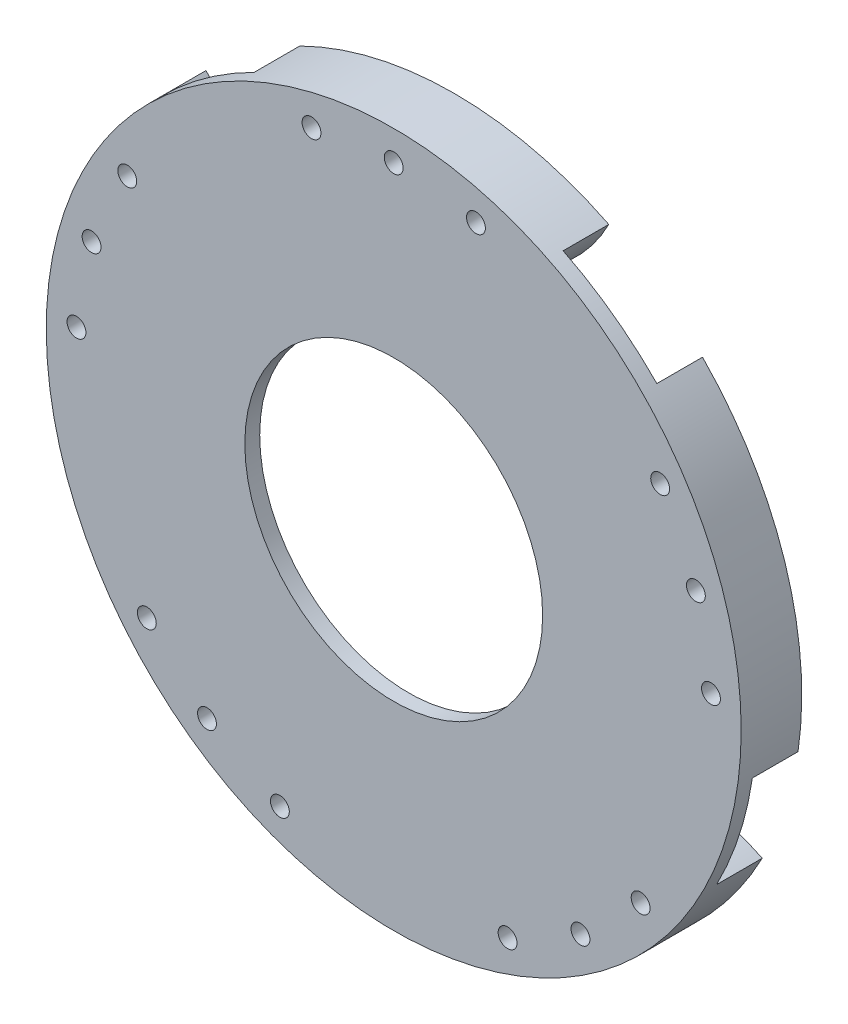
ISO-10303-21;
HEADER;
FILE_DESCRIPTION(('STEP AP214'),'2;1');
FILE_NAME('part.step','',(''),(''),'','','');
FILE_SCHEMA(('AUTOMOTIVE_DESIGN { 1 0 10303 214 1 1 1 1 }'));
ENDSEC;
DATA;
#1=APPLICATION_CONTEXT('core data for automotive mechanical design processes');
#2=APPLICATION_PROTOCOL_DEFINITION('international standard','automotive_design',2000,#1);
#3=PRODUCT_CONTEXT('',#1,'mechanical');
#4=PRODUCT('Part','Part','',(#3));
#5=PRODUCT_RELATED_PRODUCT_CATEGORY('part','',(#4));
#6=PRODUCT_DEFINITION_FORMATION('','',#4);
#7=PRODUCT_DEFINITION_CONTEXT('part definition',#1,'design');
#8=PRODUCT_DEFINITION('design','',#6,#7);
#9=PRODUCT_DEFINITION_SHAPE('','',#8);
#10=(LENGTH_UNIT() NAMED_UNIT(*) SI_UNIT(.MILLI.,.METRE.));
#11=(NAMED_UNIT(*) PLANE_ANGLE_UNIT() SI_UNIT($,.RADIAN.));
#12=(NAMED_UNIT(*) SI_UNIT($,.STERADIAN.) SOLID_ANGLE_UNIT());
#13=UNCERTAINTY_MEASURE_WITH_UNIT(LENGTH_MEASURE(1.E-05),#10,'distance_accuracy_value','');
#14=(GEOMETRIC_REPRESENTATION_CONTEXT(3) GLOBAL_UNCERTAINTY_ASSIGNED_CONTEXT((#13)) GLOBAL_UNIT_ASSIGNED_CONTEXT((#10,
#11,#12)) REPRESENTATION_CONTEXT('',''));
#15=CARTESIAN_POINT('',(0.,0.,0.));
#16=DIRECTION('',(0.,0.,1.));
#17=DIRECTION('',(1.,0.,0.));
#18=AXIS2_PLACEMENT_3D('',#15,#16,#17);
#19=CARTESIAN_POINT('',(0.,0.,1.5));
#20=DIRECTION('',(0.,0.,-1.));
#21=DIRECTION('',(-1.,0.,0.));
#22=AXIS2_PLACEMENT_3D('',#19,#20,#21);
#23=CYLINDRICAL_SURFACE('',#22,35.);
#24=CARTESIAN_POINT('',(0.,0.,1.5));
#25=DIRECTION('',(0.,0.,1.));
#26=DIRECTION('',(1.,0.,0.));
#27=AXIS2_PLACEMENT_3D('',#24,#25,#26);
#28=CIRCLE('',#27,35.);
#29=CARTESIAN_POINT('',(35.,0.,1.5));
#30=VERTEX_POINT('',#29);
#31=EDGE_CURVE('E11',#30,#30,#28,.T.);
#32=ORIENTED_EDGE('',*,*,#31,.F.);
#33=EDGE_LOOP('',(#32));
#34=FACE_BOUND('',#33,.T.);
#35=CARTESIAN_POINT('',(0.,0.,0.));
#36=DIRECTION('',(0.,0.,1.));
#37=DIRECTION('',(1.,0.,0.));
#38=AXIS2_PLACEMENT_3D('',#35,#36,#37);
#39=CIRCLE('',#38,35.);
#40=CARTESIAN_POINT('',(-15.5639088802974,31.3490787801779,0.));
#41=VERTEX_POINT('',#40);
#42=CARTESIAN_POINT('',(-25.0052333108233,24.4895550607048,0.));
#43=VERTEX_POINT('',#42);
#44=EDGE_CURVE('E43',#41,#43,#39,.T.);
#45=ORIENTED_EDGE('',*,*,#44,.T.);
#46=DIRECTION('',(0.,0.,1.));
#47=VECTOR('',#46,1.);
#48=CARTESIAN_POINT('',(-25.0052333108233,24.4895550607048,-4.6));
#49=LINE('',#48,#47);
#50=CARTESIAN_POINT('',(-25.0052333108233,24.4895550607048,-4.6));
#51=VERTEX_POINT('',#50);
#52=EDGE_CURVE('E169',#51,#43,#49,.T.);
#53=ORIENTED_EDGE('',*,*,#52,.F.);
#54=CARTESIAN_POINT('',(0.,0.,-4.6));
#55=DIRECTION('',(0.,0.,-1.));
#56=DIRECTION('',(-0.309016994374945,-0.951056516295155,0.));
#57=AXIS2_PLACEMENT_3D('',#54,#55,#56);
#58=CIRCLE('',#57,35.);
#59=CARTESIAN_POINT('',(-34.6242579966533,-5.11475885855693,-4.6));
#60=VERTEX_POINT('',#59);
#61=EDGE_CURVE('E159',#60,#51,#58,.T.);
#62=ORIENTED_EDGE('',*,*,#61,.F.);
#63=DIRECTION('',(0.,0.,1.));
#64=VECTOR('',#63,1.);
#65=CARTESIAN_POINT('',(-34.6242579966533,-5.11475885855693,-4.6));
#66=LINE('',#65,#64);
#67=CARTESIAN_POINT('',(-34.6242579966533,-5.11475885855693,0.));
#68=VERTEX_POINT('',#67);
#69=EDGE_CURVE('E164',#60,#68,#66,.T.);
#70=ORIENTED_EDGE('',*,*,#69,.T.);
#71=CARTESIAN_POINT('',(-31.0179929630072,-16.2137013833005,0.));
#72=VERTEX_POINT('',#71);
#73=EDGE_CURVE('E204',#68,#72,#39,.T.);
#74=ORIENTED_EDGE('',*,*,#73,.T.);
#75=DIRECTION('',(0.,0.,1.));
#76=VECTOR('',#75,1.);
#77=CARTESIAN_POINT('',(-31.0179929630072,-16.2137013833005,-4.6));
#78=LINE('',#77,#76);
#79=CARTESIAN_POINT('',(-31.0179929630072,-16.2137013833005,-4.6));
#80=VERTEX_POINT('',#79);
#81=EDGE_CURVE('E155',#80,#72,#78,.T.);
#82=ORIENTED_EDGE('',*,*,#81,.F.);
#83=CARTESIAN_POINT('',(0.,0.,-4.6));
#84=DIRECTION('',(0.,0.,-1.));
#85=DIRECTION('',(0.809016994374951,-0.587785252292469,0.));
#86=AXIS2_PLACEMENT_3D('',#83,#84,#85);
#87=CIRCLE('',#86,35.);
#88=CARTESIAN_POINT('',(-5.83505939687952,-34.5101735990257,-4.6));
#89=VERTEX_POINT('',#88);
#90=EDGE_CURVE('E145',#89,#80,#87,.T.);
#91=ORIENTED_EDGE('',*,*,#90,.F.);
#92=DIRECTION('',(0.,0.,1.));
#93=VECTOR('',#92,1.);
#94=CARTESIAN_POINT('',(-5.83505939687952,-34.5101735990257,-4.6));
#95=LINE('',#94,#93);
#96=CARTESIAN_POINT('',(-5.83505939687952,-34.5101735990257,0.));
#97=VERTEX_POINT('',#96);
#98=EDGE_CURVE('E150',#89,#97,#95,.T.);
#99=ORIENTED_EDGE('',*,*,#98,.T.);
#100=CARTESIAN_POINT('',(5.83505939688002,-34.5101735990256,0.));
#101=VERTEX_POINT('',#100);
#102=EDGE_CURVE('E207',#97,#101,#39,.T.);
#103=ORIENTED_EDGE('',*,*,#102,.T.);
#104=DIRECTION('',(0.,0.,1.));
#105=VECTOR('',#104,1.);
#106=CARTESIAN_POINT('',(5.83505939688003,-34.5101735990256,-4.6));
#107=LINE('',#106,#105);
#108=CARTESIAN_POINT('',(5.83505939688003,-34.5101735990256,-4.6));
#109=VERTEX_POINT('',#108);
#110=EDGE_CURVE('E141',#109,#101,#107,.T.);
#111=ORIENTED_EDGE('',*,*,#110,.F.);
#112=CARTESIAN_POINT('',(0.,0.,-4.6));
#113=DIRECTION('',(0.,0.,-1.));
#114=DIRECTION('',(0.809016994374942,0.58778525229248,0.));
#115=AXIS2_PLACEMENT_3D('',#112,#113,#114);
#116=CIRCLE('',#115,35.);
#117=CARTESIAN_POINT('',(31.0179929630074,-16.2137013833,-4.6));
#118=VERTEX_POINT('',#117);
#119=EDGE_CURVE('E130',#118,#109,#116,.T.);
#120=ORIENTED_EDGE('',*,*,#119,.F.);
#121=DIRECTION('',(0.,0.,1.));
#122=VECTOR('',#121,1.);
#123=CARTESIAN_POINT('',(31.0179929630074,-16.2137013833,-4.6));
#124=LINE('',#123,#122);
#125=CARTESIAN_POINT('',(31.0179929630074,-16.2137013833,0.));
#126=VERTEX_POINT('',#125);
#127=EDGE_CURVE('E138',#118,#126,#124,.T.);
#128=ORIENTED_EDGE('',*,*,#127,.T.);
#129=CARTESIAN_POINT('',(34.6242579966534,-5.11475885855645,0.));
#130=VERTEX_POINT('',#129);
#131=EDGE_CURVE('E128',#126,#130,#39,.T.);
#132=ORIENTED_EDGE('',*,*,#131,.T.);
#133=DIRECTION('',(0.,0.,1.));
#134=VECTOR('',#133,1.);
#135=CARTESIAN_POINT('',(34.6242579966534,-5.11475885855645,-4.6));
#136=LINE('',#135,#134);
#137=CARTESIAN_POINT('',(34.6242579966534,-5.11475885855645,-4.6));
#138=VERTEX_POINT('',#137);
#139=EDGE_CURVE('E116',#138,#130,#136,.T.);
#140=ORIENTED_EDGE('',*,*,#139,.F.);
#141=CARTESIAN_POINT('',(0.,0.,-4.6));
#142=DIRECTION('',(0.,0.,-1.));
#143=DIRECTION('',(-0.309016994374958,0.95105651629515,0.));
#144=AXIS2_PLACEMENT_3D('',#141,#142,#143);
#145=CIRCLE('',#144,35.);
#146=CARTESIAN_POINT('',(25.005233310823,24.4895550607051,-4.6));
#147=VERTEX_POINT('',#146);
#148=EDGE_CURVE('E121',#147,#138,#145,.T.);
#149=ORIENTED_EDGE('',*,*,#148,.F.);
#150=DIRECTION('',(0.,0.,1.));
#151=VECTOR('',#150,1.);
#152=CARTESIAN_POINT('',(25.005233310823,24.4895550607051,-4.6));
#153=LINE('',#152,#151);
#154=CARTESIAN_POINT('',(25.005233310823,24.4895550607051,0.));
#155=VERTEX_POINT('',#154);
#156=EDGE_CURVE('E118',#147,#155,#153,.T.);
#157=ORIENTED_EDGE('',*,*,#156,.T.);
#158=CARTESIAN_POINT('',(15.5639088802974,31.3490787801779,0.));
#159=VERTEX_POINT('',#158);
#160=EDGE_CURVE('E203',#155,#159,#39,.T.);
#161=ORIENTED_EDGE('',*,*,#160,.T.);
#162=DIRECTION('',(0.,0.,1.));
#163=VECTOR('',#162,1.);
#164=CARTESIAN_POINT('',(15.5639088802974,31.3490787801779,-4.6));
#165=LINE('',#164,#163);
#166=CARTESIAN_POINT('',(15.5639088802974,31.3490787801779,-4.6));
#167=VERTEX_POINT('',#166);
#168=EDGE_CURVE('E201',#167,#159,#165,.T.);
#169=ORIENTED_EDGE('',*,*,#168,.F.);
#170=CARTESIAN_POINT('',(0.,0.,-4.6));
#171=DIRECTION('',(0.,0.,-1.));
#172=DIRECTION('',(-1.,0.,0.));
#173=AXIS2_PLACEMENT_3D('',#170,#171,#172);
#174=CIRCLE('',#173,35.);
#175=CARTESIAN_POINT('',(-15.5639088802974,31.3490787801779,-4.6));
#176=VERTEX_POINT('',#175);
#177=EDGE_CURVE('E191',#176,#167,#174,.T.);
#178=ORIENTED_EDGE('',*,*,#177,.F.);
#179=DIRECTION('',(0.,0.,1.));
#180=VECTOR('',#179,1.);
#181=CARTESIAN_POINT('',(-15.5639088802974,31.3490787801779,-4.6));
#182=LINE('',#181,#180);
#183=EDGE_CURVE('E196',#176,#41,#182,.T.);
#184=ORIENTED_EDGE('',*,*,#183,.T.);
#185=EDGE_LOOP('',(#45,#53,#62,#70,#74,#82,#91,#99,#103,#111,#120,#128,#132,#140,#149,#157,#161,
#169,#178,#184));
#186=FACE_BOUND('',#185,.T.);
#187=ADVANCED_FACE('F35',(#34,#186),#23,.T.);
#188=CARTESIAN_POINT('',(0.,0.,1.5));
#189=DIRECTION('',(0.,0.,1.));
#190=DIRECTION('',(1.,0.,0.));
#191=AXIS2_PLACEMENT_3D('',#188,#189,#190);
#192=PLANE('',#191);
#193=CARTESIAN_POINT('',(0.,0.,1.5));
#194=DIRECTION('',(0.,0.,1.));
#195=DIRECTION('',(1.,0.,0.));
#196=AXIS2_PLACEMENT_3D('',#193,#194,#195);
#197=CIRCLE('',#196,15.);
#198=CARTESIAN_POINT('',(15.,0.,1.5));
#199=VERTEX_POINT('',#198);
#200=EDGE_CURVE('E370',#199,#199,#197,.T.);
#201=ORIENTED_EDGE('',*,*,#200,.F.);
#202=EDGE_LOOP('',(#201));
#203=FACE_BOUND('',#202,.T.);
#204=CARTESIAN_POINT('',(31.9561451121463,1.67475059977455,1.5));
#205=DIRECTION('',(0.,0.,1.));
#206=DIRECTION('',(0.0523359562429546,-0.998629534754573,0.));
#207=AXIS2_PLACEMENT_3D('',#204,#205,#206);
#208=CIRCLE('',#207,0.95);
#209=CARTESIAN_POINT('',(32.0058642705772,0.726052541757701,1.5));
#210=VERTEX_POINT('',#209);
#211=EDGE_CURVE('E365',#210,#210,#208,.T.);
#212=ORIENTED_EDGE('',*,*,#211,.F.);
#213=EDGE_LOOP('',(#212));
#214=FACE_BOUND('',#213,.T.);
#215=CARTESIAN_POINT('',(11.4677743854499,-29.8745736479104,1.5));
#216=DIRECTION('',(0.,0.,1.));
#217=DIRECTION('',(-0.933580426497199,-0.358367949545308,0.));
#218=AXIS2_PLACEMENT_3D('',#215,#216,#217);
#219=CIRCLE('',#218,0.95);
#220=CARTESIAN_POINT('',(10.5808729802775,-30.2150231999784,1.5));
#221=VERTEX_POINT('',#220);
#222=EDGE_CURVE('E360',#221,#221,#219,.T.);
#223=ORIENTED_EDGE('',*,*,#222,.F.);
#224=EDGE_LOOP('',(#223));
#225=FACE_BOUND('',#224,.T.);
#226=CARTESIAN_POINT('',(-24.868670766623,-20.1382525135949,1.5));
#227=DIRECTION('',(0.,0.,1.));
#228=DIRECTION('',(-0.629320391049841,0.777145961456968,0.));
#229=AXIS2_PLACEMENT_3D('',#226,#227,#228);
#230=CIRCLE('',#229,0.95);
#231=CARTESIAN_POINT('',(-25.4665251381203,-19.3999638502108,1.5));
#232=VERTEX_POINT('',#231);
#233=EDGE_CURVE('E355',#232,#232,#230,.T.);
#234=ORIENTED_EDGE('',*,*,#233,.F.);
#235=EDGE_LOOP('',(#234));
#236=FACE_BOUND('',#235,.T.);
#237=CARTESIAN_POINT('',(-26.8374581742536,17.4284491204808,1.5));
#238=DIRECTION('',(0.,0.,1.));
#239=DIRECTION('',(0.544639035015025,0.838670567945425,0.));
#240=AXIS2_PLACEMENT_3D('',#237,#238,#239);
#241=CIRCLE('',#240,0.95);
#242=CARTESIAN_POINT('',(-26.3200510909893,18.225186160029,1.5));
#243=VERTEX_POINT('',#242);
#244=EDGE_CURVE('E350',#243,#243,#241,.T.);
#245=ORIENTED_EDGE('',*,*,#244,.F.);
#246=EDGE_LOOP('',(#245));
#247=FACE_BOUND('',#246,.T.);
#248=CARTESIAN_POINT('',(26.8374581742534,17.4284491204812,1.5));
#249=DIRECTION('',(0.,0.,1.));
#250=DIRECTION('',(0.544639035015037,-0.838670567945417,0.));
#251=AXIS2_PLACEMENT_3D('',#248,#249,#250);
#252=CIRCLE('',#251,0.95);
#253=CARTESIAN_POINT('',(27.3548652575176,16.631712080933,1.5));
#254=VERTEX_POINT('',#253);
#255=EDGE_CURVE('E344',#254,#254,#252,.T.);
#256=ORIENTED_EDGE('',*,*,#255,.F.);
#257=EDGE_LOOP('',(#256));
#258=FACE_BOUND('',#257,.T.);
#259=CARTESIAN_POINT('',(24.8686707666233,-20.1382525135946,1.5));
#260=DIRECTION('',(0.,0.,1.));
#261=DIRECTION('',(-0.62932039104983,-0.777145961456977,0.));
#262=AXIS2_PLACEMENT_3D('',#259,#260,#261);
#263=CIRCLE('',#262,0.95);
#264=CARTESIAN_POINT('',(24.2708163951259,-20.8765411769787,1.5));
#265=VERTEX_POINT('',#264);
#266=EDGE_CURVE('E338',#265,#265,#263,.T.);
#267=ORIENTED_EDGE('',*,*,#266,.F.);
#268=EDGE_LOOP('',(#267));
#269=FACE_BOUND('',#268,.T.);
#270=CARTESIAN_POINT('',(-11.4677743854494,-29.8745736479105,1.5));
#271=DIRECTION('',(0.,0.,1.));
#272=DIRECTION('',(-0.933580426497204,0.358367949545294,0.));
#273=AXIS2_PLACEMENT_3D('',#270,#271,#272);
#274=CIRCLE('',#273,0.95);
#275=CARTESIAN_POINT('',(-12.3546757906218,-29.5341240958425,1.5));
#276=VERTEX_POINT('',#275);
#277=EDGE_CURVE('E333',#276,#276,#274,.T.);
#278=ORIENTED_EDGE('',*,*,#277,.F.);
#279=EDGE_LOOP('',(#278));
#280=FACE_BOUND('',#279,.T.);
#281=CARTESIAN_POINT('',(-31.9561451121464,1.67475059977409,1.5));
#282=DIRECTION('',(0.,0.,1.));
#283=DIRECTION('',(0.0523359562429404,0.998629534754574,0.));
#284=AXIS2_PLACEMENT_3D('',#281,#282,#283);
#285=CIRCLE('',#284,0.95);
#286=CARTESIAN_POINT('',(-31.9064259537156,2.62344865779094,1.5));
#287=VERTEX_POINT('',#286);
#288=EDGE_CURVE('E328',#287,#287,#285,.T.);
#289=ORIENTED_EDGE('',*,*,#288,.F.);
#290=EDGE_LOOP('',(#289));
#291=FACE_BOUND('',#290,.T.);
#292=CARTESIAN_POINT('',(-30.4338085214449,9.88854381999823,1.5));
#293=DIRECTION('',(0.,0.,1.));
#294=DIRECTION('',(0.309016994374945,0.951056516295155,0.));
#295=AXIS2_PLACEMENT_3D('',#292,#293,#294);
#296=CIRCLE('',#295,0.95);
#297=CARTESIAN_POINT('',(-30.1402423767888,10.7920475104786,1.5));
#298=VERTEX_POINT('',#297);
#299=EDGE_CURVE('E306',#298,#298,#296,.T.);
#300=ORIENTED_EDGE('',*,*,#299,.F.);
#301=EDGE_LOOP('',(#300));
#302=FACE_BOUND('',#301,.T.);
#303=CARTESIAN_POINT('',(-18.809128073359,-25.8885438199984,1.5));
#304=DIRECTION('',(0.,0.,1.));
#305=DIRECTION('',(-0.809016994374951,0.587785252292469,0.));
#306=AXIS2_PLACEMENT_3D('',#303,#304,#305);
#307=CIRCLE('',#306,0.95);
#308=CARTESIAN_POINT('',(-19.5776942180152,-25.3301478303206,1.5));
#309=VERTEX_POINT('',#308);
#310=EDGE_CURVE('E322',#309,#309,#307,.T.);
#311=ORIENTED_EDGE('',*,*,#310,.F.);
#312=EDGE_LOOP('',(#311));
#313=FACE_BOUND('',#312,.T.);
#314=CARTESIAN_POINT('',(18.8091280733594,-25.8885438199982,1.5));
#315=DIRECTION('',(0.,0.,1.));
#316=DIRECTION('',(-0.809016994374942,-0.58778525229248,0.));
#317=AXIS2_PLACEMENT_3D('',#314,#315,#316);
#318=CIRCLE('',#317,0.95);
#319=CARTESIAN_POINT('',(18.0405619287032,-26.446939809676,1.5));
#320=VERTEX_POINT('',#319);
#321=EDGE_CURVE('E316',#320,#320,#318,.T.);
#322=ORIENTED_EDGE('',*,*,#321,.F.);
#323=EDGE_LOOP('',(#322));
#324=FACE_BOUND('',#323,.T.);
#325=CARTESIAN_POINT('',(30.4338085214448,9.88854381999866,1.5));
#326=DIRECTION('',(0.,0.,1.));
#327=DIRECTION('',(0.309016994374958,-0.95105651629515,0.));
#328=AXIS2_PLACEMENT_3D('',#325,#326,#327);
#329=CIRCLE('',#328,0.95);
#330=CARTESIAN_POINT('',(30.727374666101,8.98504012951827,1.5));
#331=VERTEX_POINT('',#330);
#332=EDGE_CURVE('E309',#331,#331,#329,.T.);
#333=ORIENTED_EDGE('',*,*,#332,.F.);
#334=EDGE_LOOP('',(#333));
#335=FACE_BOUND('',#334,.T.);
#336=CARTESIAN_POINT('',(8.28220944328068,30.9096264412502,1.5));
#337=DIRECTION('',(0.,0.,1.));
#338=DIRECTION('',(0.965925826289068,-0.258819045102521,0.));
#339=AXIS2_PLACEMENT_3D('',#336,#337,#338);
#340=CIRCLE('',#339,0.95);
#341=CARTESIAN_POINT('',(9.1998389782553,30.6637483484028,1.5));
#342=VERTEX_POINT('',#341);
#343=EDGE_CURVE('E172',#342,#342,#340,.T.);
#344=ORIENTED_EDGE('',*,*,#343,.F.);
#345=EDGE_LOOP('',(#344));
#346=FACE_BOUND('',#345,.T.);
#347=CARTESIAN_POINT('',(-8.28220944328068,30.9096264412502,1.5));
#348=DIRECTION('',(0.,0.,1.));
#349=DIRECTION('',(0.965925826289068,0.258819045102521,0.));
#350=AXIS2_PLACEMENT_3D('',#347,#348,#349);
#351=CIRCLE('',#350,0.95);
#352=CARTESIAN_POINT('',(-7.36457990830607,31.1555045340976,1.5));
#353=VERTEX_POINT('',#352);
#354=EDGE_CURVE('E176',#353,#353,#351,.T.);
#355=ORIENTED_EDGE('',*,*,#354,.F.);
#356=EDGE_LOOP('',(#355));
#357=FACE_BOUND('',#356,.T.);
#358=CARTESIAN_POINT('',(0.,32.,1.5));
#359=DIRECTION('',(0.,0.,1.));
#360=DIRECTION('',(1.,0.,0.));
#361=AXIS2_PLACEMENT_3D('',#358,#359,#360);
#362=CIRCLE('',#361,0.95);
#363=CARTESIAN_POINT('',(0.95,32.,1.5));
#364=VERTEX_POINT('',#363);
#365=EDGE_CURVE('E182',#364,#364,#362,.T.);
#366=ORIENTED_EDGE('',*,*,#365,.F.);
#367=EDGE_LOOP('',(#366));
#368=FACE_BOUND('',#367,.T.);
#369=ORIENTED_EDGE('',*,*,#31,.T.);
#370=EDGE_LOOP('',(#369));
#371=FACE_BOUND('',#370,.T.);
#372=ADVANCED_FACE('F232',(#203,#214,#225,#236,#247,#258,#269,#280,#291,#302,#313,#324,#335,
#346,#357,#368,#371),#192,.T.);
#373=CARTESIAN_POINT('',(0.,0.,0.));
#374=DIRECTION('',(0.,0.,1.));
#375=DIRECTION('',(1.,0.,0.));
#376=AXIS2_PLACEMENT_3D('',#373,#374,#375);
#377=PLANE('',#376);
#378=CARTESIAN_POINT('',(0.,0.,0.));
#379=DIRECTION('',(0.,0.,1.));
#380=DIRECTION('',(1.,0.,0.));
#381=AXIS2_PLACEMENT_3D('',#378,#379,#380);
#382=CIRCLE('',#381,15.);
#383=CARTESIAN_POINT('',(15.,0.,0.));
#384=VERTEX_POINT('',#383);
#385=EDGE_CURVE('E38',#384,#384,#382,.T.);
#386=ORIENTED_EDGE('',*,*,#385,.T.);
#387=EDGE_LOOP('',(#386));
#388=FACE_BOUND('',#387,.T.);
#389=CARTESIAN_POINT('',(37.4240739162142,12.1598187286546,0.));
#390=DIRECTION('',(0.,0.,-1.));
#391=DIRECTION('',(-0.309016994374958,0.95105651629515,0.));
#392=AXIS2_PLACEMENT_3D('',#389,#390,#391);
#393=CIRCLE('',#392,17.5);
#394=EDGE_CURVE('E51',#130,#155,#393,.T.);
#395=ORIENTED_EDGE('',*,*,#394,.F.);
#396=ORIENTED_EDGE('',*,*,#131,.F.);
#397=CARTESIAN_POINT('',(23.1293496777091,-31.834818728654,0.));
#398=DIRECTION('',(0.,0.,-1.));
#399=DIRECTION('',(0.809016994374942,0.58778525229248,0.));
#400=AXIS2_PLACEMENT_3D('',#397,#398,#399);
#401=CIRCLE('',#400,17.5);
#402=EDGE_CURVE('E57',#101,#126,#401,.T.);
#403=ORIENTED_EDGE('',*,*,#402,.F.);
#404=ORIENTED_EDGE('',*,*,#102,.F.);
#405=CARTESIAN_POINT('',(-23.1293496777086,-31.8348187286543,0.));
#406=DIRECTION('',(0.,0.,-1.));
#407=DIRECTION('',(0.809016994374951,-0.587785252292469,0.));
#408=AXIS2_PLACEMENT_3D('',#405,#406,#407);
#409=CIRCLE('',#408,17.5);
#410=EDGE_CURVE('E144',#72,#97,#409,.T.);
#411=ORIENTED_EDGE('',*,*,#410,.F.);
#412=ORIENTED_EDGE('',*,*,#73,.F.);
#413=CARTESIAN_POINT('',(-37.4240739162143,12.1598187286541,0.));
#414=DIRECTION('',(0.,0.,-1.));
#415=DIRECTION('',(-0.309016994374945,-0.951056516295155,0.));
#416=AXIS2_PLACEMENT_3D('',#413,#414,#415);
#417=CIRCLE('',#416,17.5);
#418=EDGE_CURVE('E158',#43,#68,#417,.T.);
#419=ORIENTED_EDGE('',*,*,#418,.F.);
#420=ORIENTED_EDGE('',*,*,#44,.F.);
#421=CARTESIAN_POINT('',(0.,39.35,0.));
#422=DIRECTION('',(0.,0.,-1.));
#423=DIRECTION('',(-1.,0.,0.));
#424=AXIS2_PLACEMENT_3D('',#421,#422,#423);
#425=CIRCLE('',#424,17.5);
#426=EDGE_CURVE('E188',#159,#41,#425,.T.);
#427=ORIENTED_EDGE('',*,*,#426,.F.);
#428=ORIENTED_EDGE('',*,*,#160,.F.);
#429=EDGE_LOOP('',(#395,#396,#403,#404,#411,#412,#419,#420,#427,#428));
#430=FACE_BOUND('',#429,.T.);
#431=ADVANCED_FACE('F237',(#388,#430),#377,.F.);
#432=CARTESIAN_POINT('',(0.,39.35,-4.6));
#433=DIRECTION('',(0.,0.,1.));
#434=DIRECTION('',(1.,0.,0.));
#435=AXIS2_PLACEMENT_3D('',#432,#433,#434);
#436=CYLINDRICAL_SURFACE('',#435,17.5);
#437=ORIENTED_EDGE('',*,*,#426,.T.);
#438=ORIENTED_EDGE('',*,*,#183,.F.);
#439=CARTESIAN_POINT('',(0.,39.35,-4.6));
#440=DIRECTION('',(0.,0.,-1.));
#441=DIRECTION('',(-1.,0.,0.));
#442=AXIS2_PLACEMENT_3D('',#439,#440,#441);
#443=CIRCLE('',#442,17.5);
#444=EDGE_CURVE('E194',#167,#176,#443,.T.);
#445=ORIENTED_EDGE('',*,*,#444,.F.);
#446=ORIENTED_EDGE('',*,*,#168,.T.);
#447=EDGE_LOOP('',(#437,#438,#445,#446));
#448=FACE_BOUND('',#447,.T.);
#449=ADVANCED_FACE('F245',(#448),#436,.T.);
#450=CARTESIAN_POINT('',(0.,19.675,-4.6));
#451=DIRECTION('',(0.,0.,-1.));
#452=DIRECTION('',(-1.,0.,0.));
#453=AXIS2_PLACEMENT_3D('',#450,#451,#452);
#454=PLANE('',#453);
#455=CARTESIAN_POINT('',(8.28220944328068,30.9096264412502,-4.6));
#456=DIRECTION('',(0.,0.,1.));
#457=DIRECTION('',(0.965925826289068,-0.258819045102521,0.));
#458=AXIS2_PLACEMENT_3D('',#455,#456,#457);
#459=CIRCLE('',#458,0.95);
#460=CARTESIAN_POINT('',(9.1998389782553,30.6637483484028,-4.6));
#461=VERTEX_POINT('',#460);
#462=EDGE_CURVE('E173',#461,#461,#459,.T.);
#463=ORIENTED_EDGE('',*,*,#462,.T.);
#464=EDGE_LOOP('',(#463));
#465=FACE_BOUND('',#464,.T.);
#466=CARTESIAN_POINT('',(-8.28220944328068,30.9096264412502,-4.6));
#467=DIRECTION('',(0.,0.,1.));
#468=DIRECTION('',(0.965925826289068,0.258819045102521,0.));
#469=AXIS2_PLACEMENT_3D('',#466,#467,#468);
#470=CIRCLE('',#469,0.95);
#471=CARTESIAN_POINT('',(-7.36457990830607,31.1555045340976,-4.6));
#472=VERTEX_POINT('',#471);
#473=EDGE_CURVE('E179',#472,#472,#470,.T.);
#474=ORIENTED_EDGE('',*,*,#473,.T.);
#475=EDGE_LOOP('',(#474));
#476=FACE_BOUND('',#475,.T.);
#477=CARTESIAN_POINT('',(0.,32.,-4.6));
#478=DIRECTION('',(0.,0.,1.));
#479=DIRECTION('',(1.,0.,0.));
#480=AXIS2_PLACEMENT_3D('',#477,#478,#479);
#481=CIRCLE('',#480,0.95);
#482=CARTESIAN_POINT('',(0.95,32.,-4.6));
#483=VERTEX_POINT('',#482);
#484=EDGE_CURVE('E185',#483,#483,#481,.T.);
#485=ORIENTED_EDGE('',*,*,#484,.T.);
#486=EDGE_LOOP('',(#485));
#487=FACE_BOUND('',#486,.T.);
#488=ORIENTED_EDGE('',*,*,#177,.T.);
#489=ORIENTED_EDGE('',*,*,#444,.T.);
#490=EDGE_LOOP('',(#488,#489));
#491=FACE_BOUND('',#490,.T.);
#492=ADVANCED_FACE('F252',(#465,#476,#487,#491),#454,.T.);
#493=CARTESIAN_POINT('',(0.,32.,-4.6));
#494=DIRECTION('',(0.,0.,1.));
#495=DIRECTION('',(1.,0.,0.));
#496=AXIS2_PLACEMENT_3D('',#493,#494,#495);
#497=CYLINDRICAL_SURFACE('',#496,0.95);
#498=ORIENTED_EDGE('',*,*,#484,.F.);
#499=EDGE_LOOP('',(#498));
#500=FACE_BOUND('',#499,.T.);
#501=ORIENTED_EDGE('',*,*,#365,.T.);
#502=EDGE_LOOP('',(#501));
#503=FACE_BOUND('',#502,.T.);
#504=ADVANCED_FACE('F256',(#500,#503),#497,.F.);
#505=CARTESIAN_POINT('',(-8.28220944328068,30.9096264412502,-4.6));
#506=DIRECTION('',(0.,0.,1.));
#507=DIRECTION('',(1.,0.,0.));
#508=AXIS2_PLACEMENT_3D('',#505,#506,#507);
#509=CYLINDRICAL_SURFACE('',#508,0.95);
#510=ORIENTED_EDGE('',*,*,#473,.F.);
#511=EDGE_LOOP('',(#510));
#512=FACE_BOUND('',#511,.T.);
#513=ORIENTED_EDGE('',*,*,#354,.T.);
#514=EDGE_LOOP('',(#513));
#515=FACE_BOUND('',#514,.T.);
#516=ADVANCED_FACE('F260',(#512,#515),#509,.F.);
#517=CARTESIAN_POINT('',(8.28220944328068,30.9096264412502,-4.6));
#518=DIRECTION('',(0.,0.,1.));
#519=DIRECTION('',(1.,0.,0.));
#520=AXIS2_PLACEMENT_3D('',#517,#518,#519);
#521=CYLINDRICAL_SURFACE('',#520,0.95);
#522=ORIENTED_EDGE('',*,*,#462,.F.);
#523=EDGE_LOOP('',(#522));
#524=FACE_BOUND('',#523,.T.);
#525=ORIENTED_EDGE('',*,*,#343,.T.);
#526=EDGE_LOOP('',(#525));
#527=FACE_BOUND('',#526,.T.);
#528=ADVANCED_FACE('F264',(#524,#527),#521,.F.);
#529=CARTESIAN_POINT('',(-37.4240739162143,12.1598187286541,-4.6));
#530=DIRECTION('',(0.,0.,1.));
#531=DIRECTION('',(1.,0.,0.));
#532=AXIS2_PLACEMENT_3D('',#529,#530,#531);
#533=CYLINDRICAL_SURFACE('',#532,17.5);
#534=ORIENTED_EDGE('',*,*,#418,.T.);
#535=ORIENTED_EDGE('',*,*,#69,.F.);
#536=CARTESIAN_POINT('',(-37.4240739162143,12.1598187286541,-4.6));
#537=DIRECTION('',(0.,0.,-1.));
#538=DIRECTION('',(-0.309016994374945,-0.951056516295155,0.));
#539=AXIS2_PLACEMENT_3D('',#536,#537,#538);
#540=CIRCLE('',#539,17.5);
#541=EDGE_CURVE('E162',#51,#60,#540,.T.);
#542=ORIENTED_EDGE('',*,*,#541,.F.);
#543=ORIENTED_EDGE('',*,*,#52,.T.);
#544=EDGE_LOOP('',(#534,#535,#542,#543));
#545=FACE_BOUND('',#544,.T.);
#546=ADVANCED_FACE('F268',(#545),#533,.T.);
#547=CARTESIAN_POINT('',(-18.7120369581072,6.07990936432704,-4.6));
#548=DIRECTION('',(0.,0.,-1.));
#549=DIRECTION('',(-0.309016994374945,-0.951056516295155,0.));
#550=AXIS2_PLACEMENT_3D('',#547,#548,#549);
#551=PLANE('',#550);
#552=CARTESIAN_POINT('',(-26.8374581742536,17.4284491204808,-4.6));
#553=DIRECTION('',(0.,0.,1.));
#554=DIRECTION('',(0.544639035015025,0.838670567945425,0.));
#555=AXIS2_PLACEMENT_3D('',#552,#553,#554);
#556=CIRCLE('',#555,0.95);
#557=CARTESIAN_POINT('',(-26.3200510909893,18.225186160029,-4.6));
#558=VERTEX_POINT('',#557);
#559=EDGE_CURVE('E347',#558,#558,#556,.T.);
#560=ORIENTED_EDGE('',*,*,#559,.T.);
#561=EDGE_LOOP('',(#560));
#562=FACE_BOUND('',#561,.T.);
#563=CARTESIAN_POINT('',(-31.9561451121464,1.67475059977409,-4.6));
#564=DIRECTION('',(0.,0.,1.));
#565=DIRECTION('',(0.0523359562429404,0.998629534754574,0.));
#566=AXIS2_PLACEMENT_3D('',#563,#564,#565);
#567=CIRCLE('',#566,0.95);
#568=CARTESIAN_POINT('',(-31.9064259537156,2.62344865779094,-4.6));
#569=VERTEX_POINT('',#568);
#570=EDGE_CURVE('E313',#569,#569,#567,.T.);
#571=ORIENTED_EDGE('',*,*,#570,.T.);
#572=EDGE_LOOP('',(#571));
#573=FACE_BOUND('',#572,.T.);
#574=CARTESIAN_POINT('',(-30.4338085214449,9.88854381999823,-4.6));
#575=DIRECTION('',(0.,0.,1.));
#576=DIRECTION('',(0.309016994374945,0.951056516295155,0.));
#577=AXIS2_PLACEMENT_3D('',#574,#575,#576);
#578=CIRCLE('',#577,0.95);
#579=CARTESIAN_POINT('',(-30.1402423767888,10.7920475104786,-4.6));
#580=VERTEX_POINT('',#579);
#581=EDGE_CURVE('E304',#580,#580,#578,.T.);
#582=ORIENTED_EDGE('',*,*,#581,.T.);
#583=EDGE_LOOP('',(#582));
#584=FACE_BOUND('',#583,.T.);
#585=ORIENTED_EDGE('',*,*,#61,.T.);
#586=ORIENTED_EDGE('',*,*,#541,.T.);
#587=EDGE_LOOP('',(#585,#586));
#588=FACE_BOUND('',#587,.T.);
#589=ADVANCED_FACE('F272',(#562,#573,#584,#588),#551,.T.);
#590=CARTESIAN_POINT('',(-23.1293496777086,-31.8348187286543,-4.6));
#591=DIRECTION('',(0.,0.,1.));
#592=DIRECTION('',(1.,0.,0.));
#593=AXIS2_PLACEMENT_3D('',#590,#591,#592);
#594=CYLINDRICAL_SURFACE('',#593,17.5);
#595=ORIENTED_EDGE('',*,*,#410,.T.);
#596=ORIENTED_EDGE('',*,*,#98,.F.);
#597=CARTESIAN_POINT('',(-23.1293496777086,-31.8348187286543,-4.6));
#598=DIRECTION('',(0.,0.,-1.));
#599=DIRECTION('',(0.809016994374951,-0.587785252292469,0.));
#600=AXIS2_PLACEMENT_3D('',#597,#598,#599);
#601=CIRCLE('',#600,17.5);
#602=EDGE_CURVE('E148',#80,#89,#601,.T.);
#603=ORIENTED_EDGE('',*,*,#602,.F.);
#604=ORIENTED_EDGE('',*,*,#81,.T.);
#605=EDGE_LOOP('',(#595,#596,#603,#604));
#606=FACE_BOUND('',#605,.T.);
#607=ADVANCED_FACE('F276',(#606),#594,.T.);
#608=CARTESIAN_POINT('',(-11.5646748388543,-15.9174093643272,-4.6));
#609=DIRECTION('',(0.,0.,-1.));
#610=DIRECTION('',(0.809016994374951,-0.587785252292469,0.));
#611=AXIS2_PLACEMENT_3D('',#608,#609,#610);
#612=PLANE('',#611);
#613=CARTESIAN_POINT('',(-24.868670766623,-20.1382525135949,-4.6));
#614=DIRECTION('',(0.,0.,1.));
#615=DIRECTION('',(-0.629320391049841,0.777145961456968,0.));
#616=AXIS2_PLACEMENT_3D('',#613,#614,#615);
#617=CIRCLE('',#616,0.95);
#618=CARTESIAN_POINT('',(-25.4665251381203,-19.3999638502108,-4.6));
#619=VERTEX_POINT('',#618);
#620=EDGE_CURVE('E288',#619,#619,#617,.T.);
#621=ORIENTED_EDGE('',*,*,#620,.T.);
#622=EDGE_LOOP('',(#621));
#623=FACE_BOUND('',#622,.T.);
#624=CARTESIAN_POINT('',(-11.4677743854494,-29.8745736479105,-4.6));
#625=DIRECTION('',(0.,0.,1.));
#626=DIRECTION('',(-0.933580426497204,0.358367949545294,0.));
#627=AXIS2_PLACEMENT_3D('',#624,#625,#626);
#628=CIRCLE('',#627,0.95);
#629=CARTESIAN_POINT('',(-12.3546757906218,-29.5341240958425,-4.6));
#630=VERTEX_POINT('',#629);
#631=EDGE_CURVE('E292',#630,#630,#628,.T.);
#632=ORIENTED_EDGE('',*,*,#631,.T.);
#633=EDGE_LOOP('',(#632));
#634=FACE_BOUND('',#633,.T.);
#635=CARTESIAN_POINT('',(-18.809128073359,-25.8885438199984,-4.6));
#636=DIRECTION('',(0.,0.,1.));
#637=DIRECTION('',(-0.809016994374951,0.587785252292469,0.));
#638=AXIS2_PLACEMENT_3D('',#635,#636,#637);
#639=CIRCLE('',#638,0.95);
#640=CARTESIAN_POINT('',(-19.5776942180152,-25.3301478303206,-4.6));
#641=VERTEX_POINT('',#640);
#642=EDGE_CURVE('E296',#641,#641,#639,.T.);
#643=ORIENTED_EDGE('',*,*,#642,.T.);
#644=EDGE_LOOP('',(#643));
#645=FACE_BOUND('',#644,.T.);
#646=ORIENTED_EDGE('',*,*,#90,.T.);
#647=ORIENTED_EDGE('',*,*,#602,.T.);
#648=EDGE_LOOP('',(#646,#647));
#649=FACE_BOUND('',#648,.T.);
#650=ADVANCED_FACE('F227',(#623,#634,#645,#649),#612,.T.);
#651=CARTESIAN_POINT('',(23.1293496777091,-31.834818728654,-4.6));
#652=DIRECTION('',(0.,0.,1.));
#653=DIRECTION('',(1.,0.,0.));
#654=AXIS2_PLACEMENT_3D('',#651,#652,#653);
#655=CYLINDRICAL_SURFACE('',#654,17.5);
#656=ORIENTED_EDGE('',*,*,#402,.T.);
#657=ORIENTED_EDGE('',*,*,#127,.F.);
#658=CARTESIAN_POINT('',(23.1293496777091,-31.834818728654,-4.6));
#659=DIRECTION('',(0.,0.,-1.));
#660=DIRECTION('',(0.809016994374942,0.58778525229248,0.));
#661=AXIS2_PLACEMENT_3D('',#658,#659,#660);
#662=CIRCLE('',#661,17.5);
#663=EDGE_CURVE('E137',#109,#118,#662,.T.);
#664=ORIENTED_EDGE('',*,*,#663,.F.);
#665=ORIENTED_EDGE('',*,*,#110,.T.);
#666=EDGE_LOOP('',(#656,#657,#664,#665));
#667=FACE_BOUND('',#666,.T.);
#668=ADVANCED_FACE('F215',(#667),#655,.T.);
#669=CARTESIAN_POINT('',(11.5646748388545,-15.917409364327,-4.6));
#670=DIRECTION('',(0.,0.,-1.));
#671=DIRECTION('',(0.809016994374942,0.58778525229248,0.));
#672=AXIS2_PLACEMENT_3D('',#669,#670,#671);
#673=PLANE('',#672);
#674=CARTESIAN_POINT('',(11.4677743854499,-29.8745736479104,-4.6));
#675=DIRECTION('',(0.,0.,1.));
#676=DIRECTION('',(-0.933580426497199,-0.358367949545308,0.));
#677=AXIS2_PLACEMENT_3D('',#674,#675,#676);
#678=CIRCLE('',#677,0.95);
#679=CARTESIAN_POINT('',(10.5808729802775,-30.2150231999784,-4.6));
#680=VERTEX_POINT('',#679);
#681=EDGE_CURVE('E358',#680,#680,#678,.T.);
#682=ORIENTED_EDGE('',*,*,#681,.T.);
#683=EDGE_LOOP('',(#682));
#684=FACE_BOUND('',#683,.T.);
#685=CARTESIAN_POINT('',(24.8686707666233,-20.1382525135946,-4.6));
#686=DIRECTION('',(0.,0.,1.));
#687=DIRECTION('',(-0.62932039104983,-0.777145961456977,0.));
#688=AXIS2_PLACEMENT_3D('',#685,#686,#687);
#689=CIRCLE('',#688,0.95);
#690=CARTESIAN_POINT('',(24.2708163951259,-20.8765411769787,-4.6));
#691=VERTEX_POINT('',#690);
#692=EDGE_CURVE('E336',#691,#691,#689,.T.);
#693=ORIENTED_EDGE('',*,*,#692,.T.);
#694=EDGE_LOOP('',(#693));
#695=FACE_BOUND('',#694,.T.);
#696=CARTESIAN_POINT('',(18.8091280733594,-25.8885438199982,-4.6));
#697=DIRECTION('',(0.,0.,1.));
#698=DIRECTION('',(-0.809016994374942,-0.58778525229248,0.));
#699=AXIS2_PLACEMENT_3D('',#696,#697,#698);
#700=CIRCLE('',#699,0.95);
#701=CARTESIAN_POINT('',(18.0405619287032,-26.446939809676,-4.6));
#702=VERTEX_POINT('',#701);
#703=EDGE_CURVE('E319',#702,#702,#700,.T.);
#704=ORIENTED_EDGE('',*,*,#703,.T.);
#705=EDGE_LOOP('',(#704));
#706=FACE_BOUND('',#705,.T.);
#707=ORIENTED_EDGE('',*,*,#119,.T.);
#708=ORIENTED_EDGE('',*,*,#663,.T.);
#709=EDGE_LOOP('',(#707,#708));
#710=FACE_BOUND('',#709,.T.);
#711=ADVANCED_FACE('F218',(#684,#695,#706,#710),#673,.T.);
#712=CARTESIAN_POINT('',(37.4240739162142,12.1598187286546,-4.6));
#713=DIRECTION('',(0.,0.,1.));
#714=DIRECTION('',(1.,0.,0.));
#715=AXIS2_PLACEMENT_3D('',#712,#713,#714);
#716=CYLINDRICAL_SURFACE('',#715,17.5);
#717=ORIENTED_EDGE('',*,*,#394,.T.);
#718=ORIENTED_EDGE('',*,*,#156,.F.);
#719=CARTESIAN_POINT('',(37.4240739162142,12.1598187286546,-4.6));
#720=DIRECTION('',(0.,0.,-1.));
#721=DIRECTION('',(-0.309016994374958,0.95105651629515,0.));
#722=AXIS2_PLACEMENT_3D('',#719,#720,#721);
#723=CIRCLE('',#722,17.5);
#724=EDGE_CURVE('E112',#138,#147,#723,.T.);
#725=ORIENTED_EDGE('',*,*,#724,.F.);
#726=ORIENTED_EDGE('',*,*,#139,.T.);
#727=EDGE_LOOP('',(#717,#718,#725,#726));
#728=FACE_BOUND('',#727,.T.);
#729=ADVANCED_FACE('F114',(#728),#716,.T.);
#730=CARTESIAN_POINT('',(18.7120369581071,6.0799093643273,-4.6));
#731=DIRECTION('',(0.,0.,-1.));
#732=DIRECTION('',(-0.309016994374958,0.95105651629515,0.));
#733=AXIS2_PLACEMENT_3D('',#730,#731,#732);
#734=PLANE('',#733);
#735=CARTESIAN_POINT('',(31.9561451121463,1.67475059977455,-4.6));
#736=DIRECTION('',(0.,0.,1.));
#737=DIRECTION('',(0.0523359562429546,-0.998629534754573,0.));
#738=AXIS2_PLACEMENT_3D('',#735,#736,#737);
#739=CIRCLE('',#738,0.95);
#740=CARTESIAN_POINT('',(32.0058642705772,0.726052541757701,-4.6));
#741=VERTEX_POINT('',#740);
#742=EDGE_CURVE('E363',#741,#741,#739,.T.);
#743=ORIENTED_EDGE('',*,*,#742,.T.);
#744=EDGE_LOOP('',(#743));
#745=FACE_BOUND('',#744,.T.);
#746=CARTESIAN_POINT('',(26.8374581742534,17.4284491204812,-4.6));
#747=DIRECTION('',(0.,0.,1.));
#748=DIRECTION('',(0.544639035015037,-0.838670567945417,0.));
#749=AXIS2_PLACEMENT_3D('',#746,#747,#748);
#750=CIRCLE('',#749,0.95);
#751=CARTESIAN_POINT('',(27.3548652575176,16.631712080933,-4.6));
#752=VERTEX_POINT('',#751);
#753=EDGE_CURVE('E341',#752,#752,#750,.T.);
#754=ORIENTED_EDGE('',*,*,#753,.T.);
#755=EDGE_LOOP('',(#754));
#756=FACE_BOUND('',#755,.T.);
#757=CARTESIAN_POINT('',(30.4338085214448,9.88854381999866,-4.6));
#758=DIRECTION('',(0.,0.,1.));
#759=DIRECTION('',(0.309016994374958,-0.95105651629515,0.));
#760=AXIS2_PLACEMENT_3D('',#757,#758,#759);
#761=CIRCLE('',#760,0.95);
#762=CARTESIAN_POINT('',(30.727374666101,8.98504012951827,-4.6));
#763=VERTEX_POINT('',#762);
#764=EDGE_CURVE('E312',#763,#763,#761,.T.);
#765=ORIENTED_EDGE('',*,*,#764,.T.);
#766=EDGE_LOOP('',(#765));
#767=FACE_BOUND('',#766,.T.);
#768=ORIENTED_EDGE('',*,*,#148,.T.);
#769=ORIENTED_EDGE('',*,*,#724,.T.);
#770=EDGE_LOOP('',(#768,#769));
#771=FACE_BOUND('',#770,.T.);
#772=ADVANCED_FACE('F123',(#745,#756,#767,#771),#734,.T.);
#773=CARTESIAN_POINT('',(30.4338085214448,9.88854381999866,-4.6));
#774=DIRECTION('',(0.,0.,1.));
#775=DIRECTION('',(1.,0.,0.));
#776=AXIS2_PLACEMENT_3D('',#773,#774,#775);
#777=CYLINDRICAL_SURFACE('',#776,0.95);
#778=ORIENTED_EDGE('',*,*,#764,.F.);
#779=EDGE_LOOP('',(#778));
#780=FACE_BOUND('',#779,.T.);
#781=ORIENTED_EDGE('',*,*,#332,.T.);
#782=EDGE_LOOP('',(#781));
#783=FACE_BOUND('',#782,.T.);
#784=ADVANCED_FACE('F425',(#780,#783),#777,.F.);
#785=CARTESIAN_POINT('',(18.8091280733594,-25.8885438199982,-4.6));
#786=DIRECTION('',(0.,0.,1.));
#787=DIRECTION('',(1.,0.,0.));
#788=AXIS2_PLACEMENT_3D('',#785,#786,#787);
#789=CYLINDRICAL_SURFACE('',#788,0.95);
#790=ORIENTED_EDGE('',*,*,#703,.F.);
#791=EDGE_LOOP('',(#790));
#792=FACE_BOUND('',#791,.T.);
#793=ORIENTED_EDGE('',*,*,#321,.T.);
#794=EDGE_LOOP('',(#793));
#795=FACE_BOUND('',#794,.T.);
#796=ADVANCED_FACE('F421',(#792,#795),#789,.F.);
#797=CARTESIAN_POINT('',(-18.809128073359,-25.8885438199984,-4.6));
#798=DIRECTION('',(0.,0.,1.));
#799=DIRECTION('',(1.,0.,0.));
#800=AXIS2_PLACEMENT_3D('',#797,#798,#799);
#801=CYLINDRICAL_SURFACE('',#800,0.95);
#802=ORIENTED_EDGE('',*,*,#642,.F.);
#803=EDGE_LOOP('',(#802));
#804=FACE_BOUND('',#803,.T.);
#805=ORIENTED_EDGE('',*,*,#310,.T.);
#806=EDGE_LOOP('',(#805));
#807=FACE_BOUND('',#806,.T.);
#808=ADVANCED_FACE('F417',(#804,#807),#801,.F.);
#809=CARTESIAN_POINT('',(-30.4338085214449,9.88854381999823,-4.6));
#810=DIRECTION('',(0.,0.,1.));
#811=DIRECTION('',(1.,0.,0.));
#812=AXIS2_PLACEMENT_3D('',#809,#810,#811);
#813=CYLINDRICAL_SURFACE('',#812,0.95);
#814=ORIENTED_EDGE('',*,*,#581,.F.);
#815=EDGE_LOOP('',(#814));
#816=FACE_BOUND('',#815,.T.);
#817=ORIENTED_EDGE('',*,*,#299,.T.);
#818=EDGE_LOOP('',(#817));
#819=FACE_BOUND('',#818,.T.);
#820=ADVANCED_FACE('F413',(#816,#819),#813,.F.);
#821=CARTESIAN_POINT('',(-31.9561451121464,1.67475059977409,-4.6));
#822=DIRECTION('',(0.,0.,1.));
#823=DIRECTION('',(1.,0.,0.));
#824=AXIS2_PLACEMENT_3D('',#821,#822,#823);
#825=CYLINDRICAL_SURFACE('',#824,0.95);
#826=ORIENTED_EDGE('',*,*,#570,.F.);
#827=EDGE_LOOP('',(#826));
#828=FACE_BOUND('',#827,.T.);
#829=ORIENTED_EDGE('',*,*,#288,.T.);
#830=EDGE_LOOP('',(#829));
#831=FACE_BOUND('',#830,.T.);
#832=ADVANCED_FACE('F409',(#828,#831),#825,.F.);
#833=CARTESIAN_POINT('',(-11.4677743854494,-29.8745736479105,-4.6));
#834=DIRECTION('',(0.,0.,1.));
#835=DIRECTION('',(1.,0.,0.));
#836=AXIS2_PLACEMENT_3D('',#833,#834,#835);
#837=CYLINDRICAL_SURFACE('',#836,0.95);
#838=ORIENTED_EDGE('',*,*,#631,.F.);
#839=EDGE_LOOP('',(#838));
#840=FACE_BOUND('',#839,.T.);
#841=ORIENTED_EDGE('',*,*,#277,.T.);
#842=EDGE_LOOP('',(#841));
#843=FACE_BOUND('',#842,.T.);
#844=ADVANCED_FACE('F405',(#840,#843),#837,.F.);
#845=CARTESIAN_POINT('',(24.8686707666233,-20.1382525135946,-4.6));
#846=DIRECTION('',(0.,0.,1.));
#847=DIRECTION('',(1.,0.,0.));
#848=AXIS2_PLACEMENT_3D('',#845,#846,#847);
#849=CYLINDRICAL_SURFACE('',#848,0.95);
#850=ORIENTED_EDGE('',*,*,#692,.F.);
#851=EDGE_LOOP('',(#850));
#852=FACE_BOUND('',#851,.T.);
#853=ORIENTED_EDGE('',*,*,#266,.T.);
#854=EDGE_LOOP('',(#853));
#855=FACE_BOUND('',#854,.T.);
#856=ADVANCED_FACE('F401',(#852,#855),#849,.F.);
#857=CARTESIAN_POINT('',(26.8374581742534,17.4284491204812,-4.6));
#858=DIRECTION('',(0.,0.,1.));
#859=DIRECTION('',(1.,0.,0.));
#860=AXIS2_PLACEMENT_3D('',#857,#858,#859);
#861=CYLINDRICAL_SURFACE('',#860,0.95);
#862=ORIENTED_EDGE('',*,*,#753,.F.);
#863=EDGE_LOOP('',(#862));
#864=FACE_BOUND('',#863,.T.);
#865=ORIENTED_EDGE('',*,*,#255,.T.);
#866=EDGE_LOOP('',(#865));
#867=FACE_BOUND('',#866,.T.);
#868=ADVANCED_FACE('F397',(#864,#867),#861,.F.);
#869=CARTESIAN_POINT('',(-26.8374581742536,17.4284491204808,-4.6));
#870=DIRECTION('',(0.,0.,1.));
#871=DIRECTION('',(1.,0.,0.));
#872=AXIS2_PLACEMENT_3D('',#869,#870,#871);
#873=CYLINDRICAL_SURFACE('',#872,0.95);
#874=ORIENTED_EDGE('',*,*,#559,.F.);
#875=EDGE_LOOP('',(#874));
#876=FACE_BOUND('',#875,.T.);
#877=ORIENTED_EDGE('',*,*,#244,.T.);
#878=EDGE_LOOP('',(#877));
#879=FACE_BOUND('',#878,.T.);
#880=ADVANCED_FACE('F393',(#876,#879),#873,.F.);
#881=CARTESIAN_POINT('',(-24.868670766623,-20.1382525135949,-4.6));
#882=DIRECTION('',(0.,0.,1.));
#883=DIRECTION('',(1.,0.,0.));
#884=AXIS2_PLACEMENT_3D('',#881,#882,#883);
#885=CYLINDRICAL_SURFACE('',#884,0.95);
#886=ORIENTED_EDGE('',*,*,#620,.F.);
#887=EDGE_LOOP('',(#886));
#888=FACE_BOUND('',#887,.T.);
#889=ORIENTED_EDGE('',*,*,#233,.T.);
#890=EDGE_LOOP('',(#889));
#891=FACE_BOUND('',#890,.T.);
#892=ADVANCED_FACE('F389',(#888,#891),#885,.F.);
#893=CARTESIAN_POINT('',(11.4677743854499,-29.8745736479104,-4.6));
#894=DIRECTION('',(0.,0.,1.));
#895=DIRECTION('',(1.,0.,0.));
#896=AXIS2_PLACEMENT_3D('',#893,#894,#895);
#897=CYLINDRICAL_SURFACE('',#896,0.95);
#898=ORIENTED_EDGE('',*,*,#681,.F.);
#899=EDGE_LOOP('',(#898));
#900=FACE_BOUND('',#899,.T.);
#901=ORIENTED_EDGE('',*,*,#222,.T.);
#902=EDGE_LOOP('',(#901));
#903=FACE_BOUND('',#902,.T.);
#904=ADVANCED_FACE('F383',(#900,#903),#897,.F.);
#905=CARTESIAN_POINT('',(31.9561451121463,1.67475059977455,-4.6));
#906=DIRECTION('',(0.,0.,1.));
#907=DIRECTION('',(1.,0.,0.));
#908=AXIS2_PLACEMENT_3D('',#905,#906,#907);
#909=CYLINDRICAL_SURFACE('',#908,0.95);
#910=ORIENTED_EDGE('',*,*,#742,.F.);
#911=EDGE_LOOP('',(#910));
#912=FACE_BOUND('',#911,.T.);
#913=ORIENTED_EDGE('',*,*,#211,.T.);
#914=EDGE_LOOP('',(#913));
#915=FACE_BOUND('',#914,.T.);
#916=ADVANCED_FACE('F378',(#912,#915),#909,.F.);
#917=CARTESIAN_POINT('',(0.,0.,-4.6));
#918=DIRECTION('',(0.,0.,1.));
#919=DIRECTION('',(1.,0.,0.));
#920=AXIS2_PLACEMENT_3D('',#917,#918,#919);
#921=CYLINDRICAL_SURFACE('',#920,15.);
#922=ORIENTED_EDGE('',*,*,#200,.T.);
#923=EDGE_LOOP('',(#922));
#924=FACE_BOUND('',#923,.T.);
#925=ORIENTED_EDGE('',*,*,#385,.F.);
#926=EDGE_LOOP('',(#925));
#927=FACE_BOUND('',#926,.T.);
#928=ADVANCED_FACE('F376',(#924,#927),#921,.F.);
#929=CLOSED_SHELL('',(#187,#372,#431,#449,#492,#504,#516,#528,#546,#589,#607,#650,#668,#711,
#729,#772,#784,#796,#808,#820,#832,#844,#856,#868,#880,#892,#904,#916,#928));
#930=MANIFOLD_SOLID_BREP('B2',#929);
#931=ADVANCED_BREP_SHAPE_REPRESENTATION('',(#18,#930),#14);
#932=SHAPE_DEFINITION_REPRESENTATION(#9,#931);
ENDSEC;
END-ISO-10303-21;
